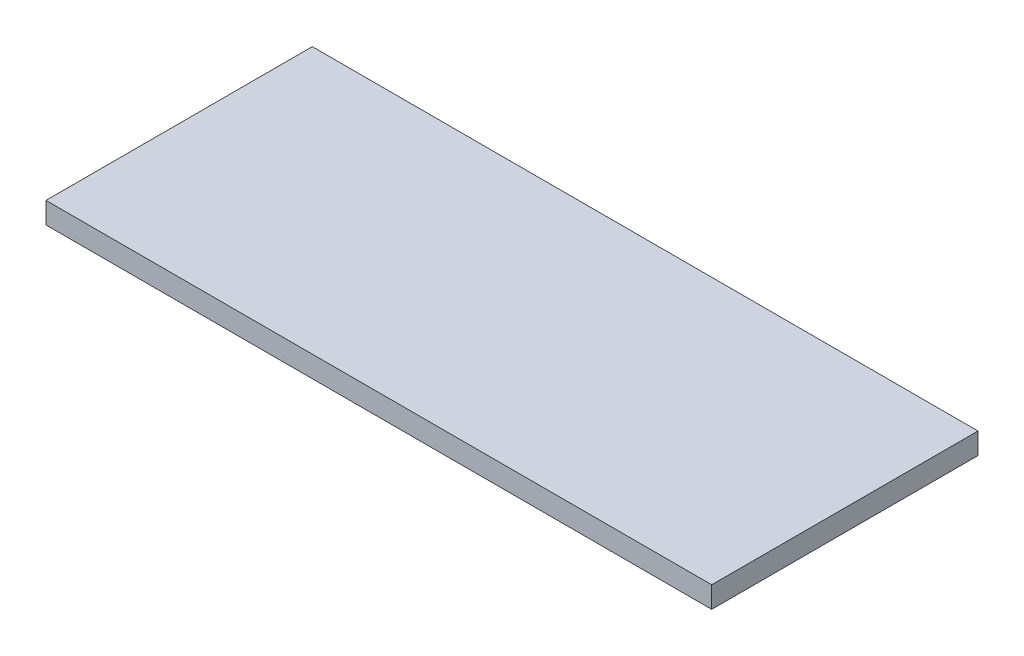
ISO-10303-21;
HEADER;
FILE_DESCRIPTION(('STEP AP214'),'2;1');
FILE_NAME('part.step','',(''),(''),'','','');
FILE_SCHEMA(('AUTOMOTIVE_DESIGN { 1 0 10303 214 1 1 1 1 }'));
ENDSEC;
DATA;
#1=APPLICATION_CONTEXT('core data for automotive mechanical design processes');
#2=APPLICATION_PROTOCOL_DEFINITION('international standard','automotive_design',2000,#1);
#3=PRODUCT_CONTEXT('',#1,'mechanical');
#4=PRODUCT('Part','Part','',(#3));
#5=PRODUCT_RELATED_PRODUCT_CATEGORY('part','',(#4));
#6=PRODUCT_DEFINITION_FORMATION('','',#4);
#7=PRODUCT_DEFINITION_CONTEXT('part definition',#1,'design');
#8=PRODUCT_DEFINITION('design','',#6,#7);
#9=PRODUCT_DEFINITION_SHAPE('','',#8);
#10=(LENGTH_UNIT() NAMED_UNIT(*) SI_UNIT(.MILLI.,.METRE.));
#11=(NAMED_UNIT(*) PLANE_ANGLE_UNIT() SI_UNIT($,.RADIAN.));
#12=(NAMED_UNIT(*) SI_UNIT($,.STERADIAN.) SOLID_ANGLE_UNIT());
#13=UNCERTAINTY_MEASURE_WITH_UNIT(LENGTH_MEASURE(1.E-05),#10,'distance_accuracy_value','');
#14=(GEOMETRIC_REPRESENTATION_CONTEXT(3) GLOBAL_UNCERTAINTY_ASSIGNED_CONTEXT((#13)) GLOBAL_UNIT_ASSIGNED_CONTEXT((#10,
#11,#12)) REPRESENTATION_CONTEXT('',''));
#15=CARTESIAN_POINT('',(0.,0.,0.));
#16=DIRECTION('',(0.,0.,1.));
#17=DIRECTION('',(1.,0.,0.));
#18=AXIS2_PLACEMENT_3D('',#15,#16,#17);
#19=CARTESIAN_POINT('',(0.,1.6,0.));
#20=DIRECTION('',(1.,0.,0.));
#21=DIRECTION('',(0.,0.,-1.));
#22=AXIS2_PLACEMENT_3D('',#19,#20,#21);
#23=PLANE('',#22);
#24=DIRECTION('',(0.,0.,1.));
#25=VECTOR('',#24,1.);
#26=CARTESIAN_POINT('',(0.,0.,0.));
#27=LINE('',#26,#25);
#28=CARTESIAN_POINT('',(0.,0.,-20.));
#29=VERTEX_POINT('',#28);
#30=CARTESIAN_POINT('',(0.,0.,0.));
#31=VERTEX_POINT('',#30);
#32=EDGE_CURVE('E102',#29,#31,#27,.T.);
#33=ORIENTED_EDGE('',*,*,#32,.T.);
#34=DIRECTION('',(0.,-1.,0.));
#35=VECTOR('',#34,1.);
#36=CARTESIAN_POINT('',(0.,1.6,0.));
#37=LINE('',#36,#35);
#38=CARTESIAN_POINT('',(0.,1.6,0.));
#39=VERTEX_POINT('',#38);
#40=EDGE_CURVE('E11',#39,#31,#37,.T.);
#41=ORIENTED_EDGE('',*,*,#40,.F.);
#42=DIRECTION('',(0.,0.,1.));
#43=VECTOR('',#42,1.);
#44=CARTESIAN_POINT('',(0.,1.6,0.));
#45=LINE('',#44,#43);
#46=CARTESIAN_POINT('',(0.,1.6,-20.));
#47=VERTEX_POINT('',#46);
#48=EDGE_CURVE('E90',#47,#39,#45,.T.);
#49=ORIENTED_EDGE('',*,*,#48,.F.);
#50=DIRECTION('',(0.,-1.,0.));
#51=VECTOR('',#50,1.);
#52=CARTESIAN_POINT('',(0.,1.6,-20.));
#53=LINE('',#52,#51);
#54=EDGE_CURVE('E98',#47,#29,#53,.T.);
#55=ORIENTED_EDGE('',*,*,#54,.T.);
#56=EDGE_LOOP('',(#33,#41,#49,#55));
#57=FACE_BOUND('',#56,.T.);
#58=ADVANCED_FACE('F39',(#57),#23,.F.);
#59=CARTESIAN_POINT('',(0.,1.6,0.));
#60=DIRECTION('',(0.,0.,-1.));
#61=DIRECTION('',(-1.,0.,0.));
#62=AXIS2_PLACEMENT_3D('',#59,#60,#61);
#63=PLANE('',#62);
#64=DIRECTION('',(1.,0.,0.));
#65=VECTOR('',#64,1.);
#66=CARTESIAN_POINT('',(0.,0.,0.));
#67=LINE('',#66,#65);
#68=CARTESIAN_POINT('',(50.,0.,0.));
#69=VERTEX_POINT('',#68);
#70=EDGE_CURVE('E94',#31,#69,#67,.T.);
#71=ORIENTED_EDGE('',*,*,#70,.T.);
#72=DIRECTION('',(0.,-1.,0.));
#73=VECTOR('',#72,1.);
#74=CARTESIAN_POINT('',(50.,1.6,0.));
#75=LINE('',#74,#73);
#76=CARTESIAN_POINT('',(50.,1.6,0.));
#77=VERTEX_POINT('',#76);
#78=EDGE_CURVE('E47',#77,#69,#75,.T.);
#79=ORIENTED_EDGE('',*,*,#78,.F.);
#80=DIRECTION('',(1.,0.,0.));
#81=VECTOR('',#80,1.);
#82=CARTESIAN_POINT('',(0.,1.6,0.));
#83=LINE('',#82,#81);
#84=EDGE_CURVE('E85',#39,#77,#83,.T.);
#85=ORIENTED_EDGE('',*,*,#84,.F.);
#86=ORIENTED_EDGE('',*,*,#40,.T.);
#87=EDGE_LOOP('',(#71,#79,#85,#86));
#88=FACE_BOUND('',#87,.T.);
#89=ADVANCED_FACE('F93',(#88),#63,.F.);
#90=CARTESIAN_POINT('',(50.,1.6,0.));
#91=DIRECTION('',(-1.,0.,0.));
#92=DIRECTION('',(0.,0.,1.));
#93=AXIS2_PLACEMENT_3D('',#90,#91,#92);
#94=PLANE('',#93);
#95=DIRECTION('',(0.,0.,-1.));
#96=VECTOR('',#95,1.);
#97=CARTESIAN_POINT('',(50.,0.,0.));
#98=LINE('',#97,#96);
#99=CARTESIAN_POINT('',(50.,0.,-20.));
#100=VERTEX_POINT('',#99);
#101=EDGE_CURVE('E72',#69,#100,#98,.T.);
#102=ORIENTED_EDGE('',*,*,#101,.T.);
#103=DIRECTION('',(0.,-1.,0.));
#104=VECTOR('',#103,1.);
#105=CARTESIAN_POINT('',(50.,1.6,-20.));
#106=LINE('',#105,#104);
#107=CARTESIAN_POINT('',(50.,1.6,-20.));
#108=VERTEX_POINT('',#107);
#109=EDGE_CURVE('E95',#108,#100,#106,.T.);
#110=ORIENTED_EDGE('',*,*,#109,.F.);
#111=DIRECTION('',(0.,0.,-1.));
#112=VECTOR('',#111,1.);
#113=CARTESIAN_POINT('',(50.,1.6,0.));
#114=LINE('',#113,#112);
#115=EDGE_CURVE('E88',#77,#108,#114,.T.);
#116=ORIENTED_EDGE('',*,*,#115,.F.);
#117=ORIENTED_EDGE('',*,*,#78,.T.);
#118=EDGE_LOOP('',(#102,#110,#116,#117));
#119=FACE_BOUND('',#118,.T.);
#120=ADVANCED_FACE('F96',(#119),#94,.F.);
#121=CARTESIAN_POINT('',(0.,1.6,-20.));
#122=DIRECTION('',(0.,0.,1.));
#123=DIRECTION('',(1.,0.,0.));
#124=AXIS2_PLACEMENT_3D('',#121,#122,#123);
#125=PLANE('',#124);
#126=DIRECTION('',(-1.,0.,0.));
#127=VECTOR('',#126,1.);
#128=CARTESIAN_POINT('',(0.,0.,-20.));
#129=LINE('',#128,#127);
#130=EDGE_CURVE('E78',#100,#29,#129,.T.);
#131=ORIENTED_EDGE('',*,*,#130,.T.);
#132=ORIENTED_EDGE('',*,*,#54,.F.);
#133=DIRECTION('',(-1.,0.,0.));
#134=VECTOR('',#133,1.);
#135=CARTESIAN_POINT('',(0.,1.6,-20.));
#136=LINE('',#135,#134);
#137=EDGE_CURVE('E55',#108,#47,#136,.T.);
#138=ORIENTED_EDGE('',*,*,#137,.F.);
#139=ORIENTED_EDGE('',*,*,#109,.T.);
#140=EDGE_LOOP('',(#131,#132,#138,#139));
#141=FACE_BOUND('',#140,.T.);
#142=ADVANCED_FACE('F109',(#141),#125,.F.);
#143=CARTESIAN_POINT('',(0.,1.6,0.));
#144=DIRECTION('',(0.,-1.,0.));
#145=DIRECTION('',(0.,0.,-1.));
#146=AXIS2_PLACEMENT_3D('',#143,#144,#145);
#147=PLANE('',#146);
#148=ORIENTED_EDGE('',*,*,#48,.T.);
#149=ORIENTED_EDGE('',*,*,#84,.T.);
#150=ORIENTED_EDGE('',*,*,#115,.T.);
#151=ORIENTED_EDGE('',*,*,#137,.T.);
#152=EDGE_LOOP('',(#148,#149,#150,#151));
#153=FACE_BOUND('',#152,.T.);
#154=ADVANCED_FACE('F86',(#153),#147,.F.);
#155=CARTESIAN_POINT('',(0.,0.,0.));
#156=DIRECTION('',(0.,-1.,0.));
#157=DIRECTION('',(0.,0.,-1.));
#158=AXIS2_PLACEMENT_3D('',#155,#156,#157);
#159=PLANE('',#158);
#160=ORIENTED_EDGE('',*,*,#32,.F.);
#161=ORIENTED_EDGE('',*,*,#130,.F.);
#162=ORIENTED_EDGE('',*,*,#101,.F.);
#163=ORIENTED_EDGE('',*,*,#70,.F.);
#164=EDGE_LOOP('',(#160,#161,#162,#163));
#165=FACE_BOUND('',#164,.T.);
#166=ADVANCED_FACE('F112',(#165),#159,.T.);
#167=CLOSED_SHELL('',(#58,#89,#120,#142,#154,#166));
#168=MANIFOLD_SOLID_BREP('B2',#167);
#169=ADVANCED_BREP_SHAPE_REPRESENTATION('',(#18,#168),#14);
#170=SHAPE_DEFINITION_REPRESENTATION(#9,#169);
ENDSEC;
END-ISO-10303-21;
